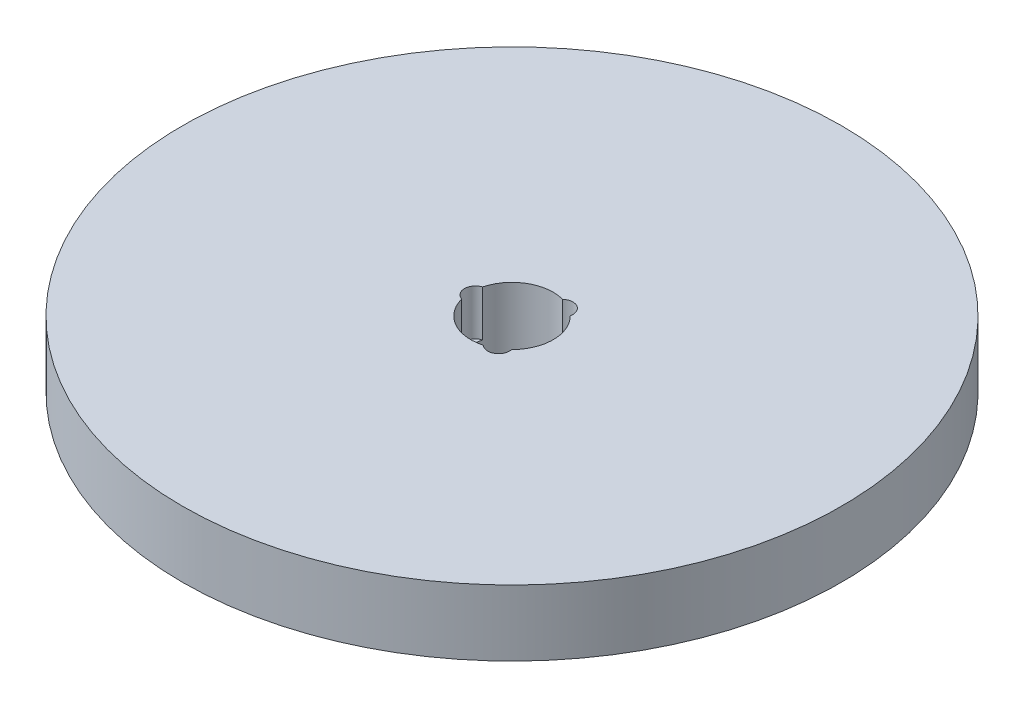
ISO-10303-21;
HEADER;
FILE_DESCRIPTION(('STEP AP214'),'2;1');
FILE_NAME('part.step','',(''),(''),'','','');
FILE_SCHEMA(('AUTOMOTIVE_DESIGN { 1 0 10303 214 1 1 1 1 }'));
ENDSEC;
DATA;
#1=APPLICATION_CONTEXT('core data for automotive mechanical design processes');
#2=APPLICATION_PROTOCOL_DEFINITION('international standard','automotive_design',2000,#1);
#3=PRODUCT_CONTEXT('',#1,'mechanical');
#4=PRODUCT('Part','Part','',(#3));
#5=PRODUCT_RELATED_PRODUCT_CATEGORY('part','',(#4));
#6=PRODUCT_DEFINITION_FORMATION('','',#4);
#7=PRODUCT_DEFINITION_CONTEXT('part definition',#1,'design');
#8=PRODUCT_DEFINITION('design','',#6,#7);
#9=PRODUCT_DEFINITION_SHAPE('','',#8);
#10=(LENGTH_UNIT() NAMED_UNIT(*) SI_UNIT(.MILLI.,.METRE.));
#11=(NAMED_UNIT(*) PLANE_ANGLE_UNIT() SI_UNIT($,.RADIAN.));
#12=(NAMED_UNIT(*) SI_UNIT($,.STERADIAN.) SOLID_ANGLE_UNIT());
#13=UNCERTAINTY_MEASURE_WITH_UNIT(LENGTH_MEASURE(1.E-05),#10,'distance_accuracy_value','');
#14=(GEOMETRIC_REPRESENTATION_CONTEXT(3) GLOBAL_UNCERTAINTY_ASSIGNED_CONTEXT((#13)) GLOBAL_UNIT_ASSIGNED_CONTEXT((#10,
#11,#12)) REPRESENTATION_CONTEXT('',''));
#15=CARTESIAN_POINT('',(0.,0.,0.));
#16=DIRECTION('',(0.,0.,1.));
#17=DIRECTION('',(1.,0.,0.));
#18=AXIS2_PLACEMENT_3D('',#15,#16,#17);
#19=CARTESIAN_POINT('',(0.,12.,0.));
#20=DIRECTION('',(0.,-1.,0.));
#21=DIRECTION('',(0.,0.,-1.));
#22=AXIS2_PLACEMENT_3D('',#19,#20,#21);
#23=CYLINDRICAL_SURFACE('',#22,60.);
#24=CARTESIAN_POINT('',(0.,12.,0.));
#25=DIRECTION('',(0.,1.,0.));
#26=DIRECTION('',(0.,0.,1.));
#27=AXIS2_PLACEMENT_3D('',#24,#25,#26);
#28=CIRCLE('',#27,60.);
#29=CARTESIAN_POINT('',(0.,12.,60.));
#30=VERTEX_POINT('',#29);
#31=EDGE_CURVE('E130',#30,#30,#28,.T.);
#32=ORIENTED_EDGE('',*,*,#31,.F.);
#33=EDGE_LOOP('',(#32));
#34=FACE_BOUND('',#33,.T.);
#35=CARTESIAN_POINT('',(0.,0.,0.));
#36=DIRECTION('',(0.,1.,0.));
#37=DIRECTION('',(0.,0.,1.));
#38=AXIS2_PLACEMENT_3D('',#35,#36,#37);
#39=CIRCLE('',#38,60.);
#40=CARTESIAN_POINT('',(0.,0.,60.));
#41=VERTEX_POINT('',#40);
#42=EDGE_CURVE('E117',#41,#41,#39,.T.);
#43=ORIENTED_EDGE('',*,*,#42,.T.);
#44=EDGE_LOOP('',(#43));
#45=FACE_BOUND('',#44,.T.);
#46=ADVANCED_FACE('F39',(#34,#45),#23,.T.);
#47=CARTESIAN_POINT('',(0.,12.,0.));
#48=DIRECTION('',(0.,1.,0.));
#49=DIRECTION('',(0.,0.,1.));
#50=AXIS2_PLACEMENT_3D('',#47,#48,#49);
#51=PLANE('',#50);
#52=CARTESIAN_POINT('',(3.3286496912151,12.,5.76539038578295));
#53=DIRECTION('',(0.,1.,0.));
#54=DIRECTION('',(0.866025403784436,0.,-0.500000000000004));
#55=AXIS2_PLACEMENT_3D('',#52,#53,#54);
#56=CIRCLE('',#55,1.98694641098881);
#57=CARTESIAN_POINT('',(1.9878637135555,12.,7.2317631222496));
#58=VERTEX_POINT('',#57);
#59=CARTESIAN_POINT('',(5.26895872124192,12.,5.33742203632509));
#60=VERTEX_POINT('',#59);
#61=EDGE_CURVE('E148',#58,#60,#56,.T.);
#62=ORIENTED_EDGE('',*,*,#61,.F.);
#63=CARTESIAN_POINT('',(0.,12.,0.));
#64=DIRECTION('',(0.,1.,0.));
#65=DIRECTION('',(0.,0.,1.));
#66=AXIS2_PLACEMENT_3D('',#63,#64,#65);
#67=CIRCLE('',#66,7.5);
#68=CARTESIAN_POINT('',(-7.25682243479737,12.,1.8943410859245));
#69=VERTEX_POINT('',#68);
#70=EDGE_CURVE('E113',#69,#58,#67,.T.);
#71=ORIENTED_EDGE('',*,*,#70,.F.);
#72=CARTESIAN_POINT('',(-6.65729938243015,12.,0.));
#73=DIRECTION('',(0.,1.,0.));
#74=DIRECTION('',(0.,0.,1.));
#75=AXIS2_PLACEMENT_3D('',#72,#73,#74);
#76=CIRCLE('',#75,1.98694641098881);
#77=CARTESIAN_POINT('',(-7.25682243479737,12.,-1.8943410859245));
#78=VERTEX_POINT('',#77);
#79=EDGE_CURVE('E125',#78,#69,#76,.T.);
#80=ORIENTED_EDGE('',*,*,#79,.F.);
#81=CARTESIAN_POINT('',(1.9878637135554,12.,-7.23176312224963));
#82=VERTEX_POINT('',#81);
#83=EDGE_CURVE('E107',#82,#78,#67,.T.);
#84=ORIENTED_EDGE('',*,*,#83,.F.);
#85=CARTESIAN_POINT('',(3.32864969121502,12.,-5.765390385783));
#86=DIRECTION('',(0.,1.,0.));
#87=DIRECTION('',(-0.866025403784443,0.,-0.499999999999992));
#88=AXIS2_PLACEMENT_3D('',#85,#86,#87);
#89=CIRCLE('',#88,1.98694641098881);
#90=CARTESIAN_POINT('',(5.26895872124185,12.,-5.33742203632517));
#91=VERTEX_POINT('',#90);
#92=EDGE_CURVE('E95',#91,#82,#89,.T.);
#93=ORIENTED_EDGE('',*,*,#92,.F.);
#94=EDGE_CURVE('E106',#60,#91,#67,.T.);
#95=ORIENTED_EDGE('',*,*,#94,.F.);
#96=EDGE_LOOP('',(#62,#71,#80,#84,#93,#95));
#97=FACE_BOUND('',#96,.T.);
#98=ORIENTED_EDGE('',*,*,#31,.T.);
#99=EDGE_LOOP('',(#98));
#100=FACE_BOUND('',#99,.T.);
#101=ADVANCED_FACE('F102',(#97,#100),#51,.T.);
#102=CARTESIAN_POINT('',(0.,0.,0.));
#103=DIRECTION('',(0.,1.,0.));
#104=DIRECTION('',(0.,0.,1.));
#105=AXIS2_PLACEMENT_3D('',#102,#103,#104);
#106=PLANE('',#105);
#107=CARTESIAN_POINT('',(0.,0.,0.));
#108=DIRECTION('',(0.,1.,0.));
#109=DIRECTION('',(0.,0.,1.));
#110=AXIS2_PLACEMENT_3D('',#107,#108,#109);
#111=CIRCLE('',#110,7.5);
#112=CARTESIAN_POINT('',(0.,0.,7.5));
#113=VERTEX_POINT('',#112);
#114=EDGE_CURVE('E118',#113,#113,#111,.T.);
#115=ORIENTED_EDGE('',*,*,#114,.T.);
#116=EDGE_LOOP('',(#115));
#117=FACE_BOUND('',#116,.T.);
#118=ORIENTED_EDGE('',*,*,#42,.F.);
#119=EDGE_LOOP('',(#118));
#120=FACE_BOUND('',#119,.T.);
#121=ADVANCED_FACE('F161',(#117,#120),#106,.F.);
#122=CARTESIAN_POINT('',(0.,12.,0.));
#123=DIRECTION('',(0.,-1.,0.));
#124=DIRECTION('',(0.,0.,-1.));
#125=AXIS2_PLACEMENT_3D('',#122,#123,#124);
#126=CYLINDRICAL_SURFACE('',#125,7.5);
#127=DIRECTION('',(0.,1.,0.));
#128=VECTOR('',#127,1.);
#129=CARTESIAN_POINT('',(1.9878637135555,7.819223319342,7.2317631222496));
#130=LINE('',#129,#128);
#131=CARTESIAN_POINT('',(1.9878637135555,3.638446638684,7.2317631222496));
#132=VERTEX_POINT('',#131);
#133=EDGE_CURVE('E11',#132,#58,#130,.T.);
#134=ORIENTED_EDGE('',*,*,#133,.F.);
#135=CARTESIAN_POINT('',(0.,3.638446638684,0.));
#136=DIRECTION('',(0.,1.,0.));
#137=DIRECTION('',(0.,0.,1.));
#138=AXIS2_PLACEMENT_3D('',#135,#136,#137);
#139=CIRCLE('',#138,7.5);
#140=CARTESIAN_POINT('',(5.26895872124192,3.638446638684,5.33742203632509));
#141=VERTEX_POINT('',#140);
#142=EDGE_CURVE('E100',#132,#141,#139,.T.);
#143=ORIENTED_EDGE('',*,*,#142,.T.);
#144=DIRECTION('',(0.,1.,0.));
#145=VECTOR('',#144,1.);
#146=CARTESIAN_POINT('',(5.26895872124192,7.819223319342,5.33742203632509));
#147=LINE('',#146,#145);
#148=EDGE_CURVE('E46',#60,#141,#147,.F.);
#149=ORIENTED_EDGE('',*,*,#148,.F.);
#150=ORIENTED_EDGE('',*,*,#94,.T.);
#151=DIRECTION('',(0.,1.,0.));
#152=VECTOR('',#151,1.);
#153=CARTESIAN_POINT('',(5.26895872124185,7.819223319342,-5.33742203632516));
#154=LINE('',#153,#152);
#155=CARTESIAN_POINT('',(5.26895872124185,3.638446638684,-5.33742203632517));
#156=VERTEX_POINT('',#155);
#157=EDGE_CURVE('E90',#156,#91,#154,.T.);
#158=ORIENTED_EDGE('',*,*,#157,.F.);
#159=CARTESIAN_POINT('',(0.,3.638446638684,0.));
#160=DIRECTION('',(0.,1.,0.));
#161=DIRECTION('',(0.,0.,1.));
#162=AXIS2_PLACEMENT_3D('',#159,#160,#161);
#163=CIRCLE('',#162,7.5);
#164=CARTESIAN_POINT('',(1.9878637135554,3.638446638684,-7.23176312224963));
#165=VERTEX_POINT('',#164);
#166=EDGE_CURVE('E143',#156,#165,#163,.T.);
#167=ORIENTED_EDGE('',*,*,#166,.T.);
#168=DIRECTION('',(0.,1.,0.));
#169=VECTOR('',#168,1.);
#170=CARTESIAN_POINT('',(1.9878637135554,7.819223319342,-7.23176312224963));
#171=LINE('',#170,#169);
#172=EDGE_CURVE('E98',#82,#165,#171,.F.);
#173=ORIENTED_EDGE('',*,*,#172,.F.);
#174=ORIENTED_EDGE('',*,*,#83,.T.);
#175=DIRECTION('',(0.,1.,0.));
#176=VECTOR('',#175,1.);
#177=CARTESIAN_POINT('',(-7.25682243479737,7.819223319342,-1.8943410859245));
#178=LINE('',#177,#176);
#179=CARTESIAN_POINT('',(-7.25682243479737,3.638446638684,-1.8943410859245));
#180=VERTEX_POINT('',#179);
#181=EDGE_CURVE('E137',#180,#78,#178,.T.);
#182=ORIENTED_EDGE('',*,*,#181,.F.);
#183=CARTESIAN_POINT('',(0.,3.638446638684,0.));
#184=DIRECTION('',(0.,1.,0.));
#185=DIRECTION('',(0.,0.,1.));
#186=AXIS2_PLACEMENT_3D('',#183,#184,#185);
#187=CIRCLE('',#186,7.5);
#188=CARTESIAN_POINT('',(-7.25682243479737,3.638446638684,1.8943410859245));
#189=VERTEX_POINT('',#188);
#190=EDGE_CURVE('E128',#180,#189,#187,.T.);
#191=ORIENTED_EDGE('',*,*,#190,.T.);
#192=DIRECTION('',(0.,1.,0.));
#193=VECTOR('',#192,1.);
#194=CARTESIAN_POINT('',(-7.25682243479737,7.819223319342,1.8943410859245));
#195=LINE('',#194,#193);
#196=EDGE_CURVE('E134',#69,#189,#195,.F.);
#197=ORIENTED_EDGE('',*,*,#196,.F.);
#198=ORIENTED_EDGE('',*,*,#70,.T.);
#199=EDGE_LOOP('',(#134,#143,#149,#150,#158,#167,#173,#174,#182,#191,#197,#198));
#200=FACE_BOUND('',#199,.T.);
#201=ORIENTED_EDGE('',*,*,#114,.F.);
#202=EDGE_LOOP('',(#201));
#203=FACE_BOUND('',#202,.T.);
#204=ADVANCED_FACE('F115',(#200,#203),#126,.F.);
#205=CARTESIAN_POINT('',(-6.65729938243015,3.638446638684,0.));
#206=DIRECTION('',(0.,1.,0.));
#207=DIRECTION('',(0.,0.,1.));
#208=AXIS2_PLACEMENT_3D('',#205,#206,#207);
#209=CYLINDRICAL_SURFACE('',#208,1.98694641098881);
#210=ORIENTED_EDGE('',*,*,#181,.T.);
#211=ORIENTED_EDGE('',*,*,#79,.T.);
#212=ORIENTED_EDGE('',*,*,#196,.T.);
#213=CARTESIAN_POINT('',(-6.65729938243015,3.638446638684,0.));
#214=DIRECTION('',(0.,1.,0.));
#215=DIRECTION('',(0.,0.,1.));
#216=AXIS2_PLACEMENT_3D('',#213,#214,#215);
#217=CIRCLE('',#216,1.98694641098881);
#218=EDGE_CURVE('E127',#180,#189,#217,.T.);
#219=ORIENTED_EDGE('',*,*,#218,.F.);
#220=EDGE_LOOP('',(#210,#211,#212,#219));
#221=FACE_BOUND('',#220,.T.);
#222=ADVANCED_FACE('F175',(#221),#209,.F.);
#223=CARTESIAN_POINT('',(-6.65729938243015,3.638446638684,0.));
#224=DIRECTION('',(0.,1.,0.));
#225=DIRECTION('',(0.,0.,1.));
#226=AXIS2_PLACEMENT_3D('',#223,#224,#225);
#227=PLANE('',#226);
#228=ORIENTED_EDGE('',*,*,#218,.T.);
#229=ORIENTED_EDGE('',*,*,#190,.F.);
#230=EDGE_LOOP('',(#228,#229));
#231=FACE_BOUND('',#230,.T.);
#232=ADVANCED_FACE('F176',(#231),#227,.T.);
#233=CARTESIAN_POINT('',(3.32864969121502,3.638446638684,-5.765390385783));
#234=DIRECTION('',(0.,1.,0.));
#235=DIRECTION('',(0.,0.,1.));
#236=AXIS2_PLACEMENT_3D('',#233,#234,#235);
#237=CYLINDRICAL_SURFACE('',#236,1.98694641098881);
#238=ORIENTED_EDGE('',*,*,#157,.T.);
#239=ORIENTED_EDGE('',*,*,#92,.T.);
#240=ORIENTED_EDGE('',*,*,#172,.T.);
#241=CARTESIAN_POINT('',(3.32864969121502,3.638446638684,-5.765390385783));
#242=DIRECTION('',(0.,1.,0.));
#243=DIRECTION('',(-0.866025403784443,0.,-0.499999999999992));
#244=AXIS2_PLACEMENT_3D('',#241,#242,#243);
#245=CIRCLE('',#244,1.98694641098881);
#246=EDGE_CURVE('E56',#156,#165,#245,.T.);
#247=ORIENTED_EDGE('',*,*,#246,.F.);
#248=EDGE_LOOP('',(#238,#239,#240,#247));
#249=FACE_BOUND('',#248,.T.);
#250=ADVANCED_FACE('F93',(#249),#237,.F.);
#251=CARTESIAN_POINT('',(3.32864969121502,3.638446638684,-5.765390385783));
#252=DIRECTION('',(0.,1.,0.));
#253=DIRECTION('',(-0.866025403784443,0.,-0.499999999999992));
#254=AXIS2_PLACEMENT_3D('',#251,#252,#253);
#255=PLANE('',#254);
#256=ORIENTED_EDGE('',*,*,#246,.T.);
#257=ORIENTED_EDGE('',*,*,#166,.F.);
#258=EDGE_LOOP('',(#256,#257));
#259=FACE_BOUND('',#258,.T.);
#260=ADVANCED_FACE('F153',(#259),#255,.T.);
#261=CARTESIAN_POINT('',(3.3286496912151,3.638446638684,5.76539038578295));
#262=DIRECTION('',(0.,1.,0.));
#263=DIRECTION('',(0.,0.,1.));
#264=AXIS2_PLACEMENT_3D('',#261,#262,#263);
#265=CYLINDRICAL_SURFACE('',#264,1.98694641098881);
#266=ORIENTED_EDGE('',*,*,#133,.T.);
#267=ORIENTED_EDGE('',*,*,#61,.T.);
#268=ORIENTED_EDGE('',*,*,#148,.T.);
#269=CARTESIAN_POINT('',(3.3286496912151,3.638446638684,5.76539038578295));
#270=DIRECTION('',(0.,1.,0.));
#271=DIRECTION('',(0.866025403784436,0.,-0.500000000000004));
#272=AXIS2_PLACEMENT_3D('',#269,#270,#271);
#273=CIRCLE('',#272,1.98694641098881);
#274=EDGE_CURVE('E55',#132,#141,#273,.T.);
#275=ORIENTED_EDGE('',*,*,#274,.F.);
#276=EDGE_LOOP('',(#266,#267,#268,#275));
#277=FACE_BOUND('',#276,.T.);
#278=ADVANCED_FACE('F144',(#277),#265,.F.);
#279=CARTESIAN_POINT('',(3.3286496912151,3.638446638684,5.76539038578295));
#280=DIRECTION('',(0.,1.,0.));
#281=DIRECTION('',(0.866025403784436,0.,-0.500000000000004));
#282=AXIS2_PLACEMENT_3D('',#279,#280,#281);
#283=PLANE('',#282);
#284=ORIENTED_EDGE('',*,*,#274,.T.);
#285=ORIENTED_EDGE('',*,*,#142,.F.);
#286=EDGE_LOOP('',(#284,#285));
#287=FACE_BOUND('',#286,.T.);
#288=ADVANCED_FACE('F150',(#287),#283,.T.);
#289=CLOSED_SHELL('',(#46,#101,#121,#204,#222,#232,#250,#260,#278,#288));
#290=MANIFOLD_SOLID_BREP('B2',#289);
#291=ADVANCED_BREP_SHAPE_REPRESENTATION('',(#18,#290),#14);
#292=SHAPE_DEFINITION_REPRESENTATION(#9,#291);
ENDSEC;
END-ISO-10303-21;
